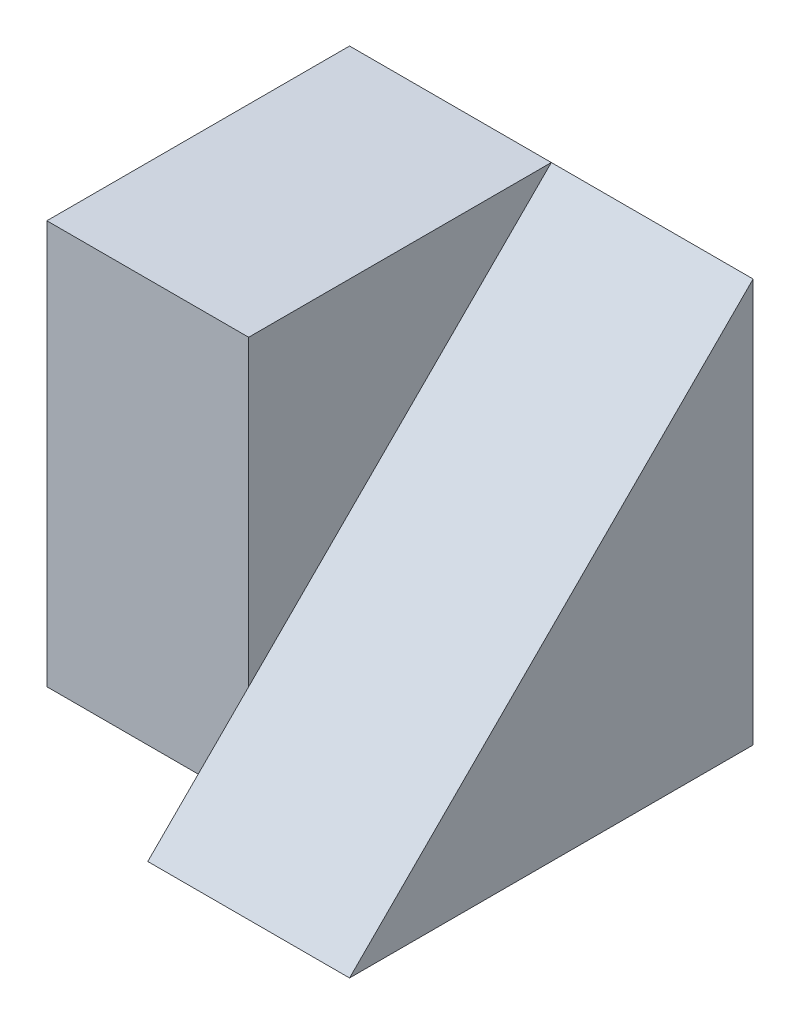
ISO-10303-21;
HEADER;
FILE_DESCRIPTION(('STEP AP214'),'2;1');
FILE_NAME('part.step','',(''),(''),'','','');
FILE_SCHEMA(('AUTOMOTIVE_DESIGN { 1 0 10303 214 1 1 1 1 }'));
ENDSEC;
DATA;
#1=APPLICATION_CONTEXT('core data for automotive mechanical design processes');
#2=APPLICATION_PROTOCOL_DEFINITION('international standard','automotive_design',2000,#1);
#3=PRODUCT_CONTEXT('',#1,'mechanical');
#4=PRODUCT('Part','Part','',(#3));
#5=PRODUCT_RELATED_PRODUCT_CATEGORY('part','',(#4));
#6=PRODUCT_DEFINITION_FORMATION('','',#4);
#7=PRODUCT_DEFINITION_CONTEXT('part definition',#1,'design');
#8=PRODUCT_DEFINITION('design','',#6,#7);
#9=PRODUCT_DEFINITION_SHAPE('','',#8);
#10=(LENGTH_UNIT() NAMED_UNIT(*) SI_UNIT(.MILLI.,.METRE.));
#11=(NAMED_UNIT(*) PLANE_ANGLE_UNIT() SI_UNIT($,.RADIAN.));
#12=(NAMED_UNIT(*) SI_UNIT($,.STERADIAN.) SOLID_ANGLE_UNIT());
#13=UNCERTAINTY_MEASURE_WITH_UNIT(LENGTH_MEASURE(1.E-05),#10,'distance_accuracy_value','');
#14=(GEOMETRIC_REPRESENTATION_CONTEXT(3) GLOBAL_UNCERTAINTY_ASSIGNED_CONTEXT((#13)) GLOBAL_UNIT_ASSIGNED_CONTEXT((#10,
#11,#12)) REPRESENTATION_CONTEXT('',''));
#15=CARTESIAN_POINT('',(0.,0.,0.));
#16=DIRECTION('',(0.,0.,1.));
#17=DIRECTION('',(1.,0.,0.));
#18=AXIS2_PLACEMENT_3D('',#15,#16,#17);
#19=CARTESIAN_POINT('',(2.,0.,0.));
#20=DIRECTION('',(0.,1.,0.));
#21=DIRECTION('',(0.,0.,1.));
#22=AXIS2_PLACEMENT_3D('',#19,#20,#21);
#23=PLANE('',#22);
#24=DIRECTION('',(0.,0.,-1.));
#25=VECTOR('',#24,1.);
#26=CARTESIAN_POINT('',(0.,0.,0.));
#27=LINE('',#26,#25);
#28=CARTESIAN_POINT('',(0.,0.,0.));
#29=VERTEX_POINT('',#28);
#30=CARTESIAN_POINT('',(0.,0.,-1.));
#31=VERTEX_POINT('',#30);
#32=EDGE_CURVE('E97',#29,#31,#27,.T.);
#33=ORIENTED_EDGE('',*,*,#32,.T.);
#34=DIRECTION('',(1.,0.,0.));
#35=VECTOR('',#34,1.);
#36=CARTESIAN_POINT('',(-2.,0.,-1.));
#37=LINE('',#36,#35);
#38=CARTESIAN_POINT('',(-2.,0.,-1.));
#39=VERTEX_POINT('',#38);
#40=EDGE_CURVE('E102',#39,#31,#37,.T.);
#41=ORIENTED_EDGE('',*,*,#40,.F.);
#42=DIRECTION('',(0.,0.,1.));
#43=VECTOR('',#42,1.);
#44=CARTESIAN_POINT('',(-2.,0.,-4.));
#45=LINE('',#44,#43);
#46=CARTESIAN_POINT('',(-2.,0.,-4.));
#47=VERTEX_POINT('',#46);
#48=EDGE_CURVE('E119',#47,#39,#45,.T.);
#49=ORIENTED_EDGE('',*,*,#48,.F.);
#50=DIRECTION('',(-1.,0.,0.));
#51=VECTOR('',#50,1.);
#52=CARTESIAN_POINT('',(2.,0.,-4.));
#53=LINE('',#52,#51);
#54=CARTESIAN_POINT('',(2.,0.,-4.));
#55=VERTEX_POINT('',#54);
#56=EDGE_CURVE('E42',#55,#47,#53,.T.);
#57=ORIENTED_EDGE('',*,*,#56,.F.);
#58=DIRECTION('',(0.,0.,-1.));
#59=VECTOR('',#58,1.);
#60=CARTESIAN_POINT('',(2.,0.,0.));
#61=LINE('',#60,#59);
#62=CARTESIAN_POINT('',(2.,0.,0.));
#63=VERTEX_POINT('',#62);
#64=EDGE_CURVE('E58',#63,#55,#61,.T.);
#65=ORIENTED_EDGE('',*,*,#64,.F.);
#66=DIRECTION('',(-1.,0.,0.));
#67=VECTOR('',#66,1.);
#68=CARTESIAN_POINT('',(2.,0.,0.));
#69=LINE('',#68,#67);
#70=EDGE_CURVE('E11',#63,#29,#69,.T.);
#71=ORIENTED_EDGE('',*,*,#70,.T.);
#72=EDGE_LOOP('',(#33,#41,#49,#57,#65,#71));
#73=FACE_BOUND('',#72,.T.);
#74=ADVANCED_FACE('F33',(#73),#23,.F.);
#75=CARTESIAN_POINT('',(2.,0.,-4.));
#76=DIRECTION('',(0.,0.,1.));
#77=DIRECTION('',(1.,0.,0.));
#78=AXIS2_PLACEMENT_3D('',#75,#76,#77);
#79=PLANE('',#78);
#80=ORIENTED_EDGE('',*,*,#56,.T.);
#81=DIRECTION('',(0.,-1.,0.));
#82=VECTOR('',#81,1.);
#83=CARTESIAN_POINT('',(-2.,4.,-4.));
#84=LINE('',#83,#82);
#85=CARTESIAN_POINT('',(-2.,4.,-4.));
#86=VERTEX_POINT('',#85);
#87=EDGE_CURVE('E123',#86,#47,#84,.T.);
#88=ORIENTED_EDGE('',*,*,#87,.F.);
#89=DIRECTION('',(-1.,0.,0.));
#90=VECTOR('',#89,1.);
#91=CARTESIAN_POINT('',(2.,4.,-4.));
#92=LINE('',#91,#90);
#93=CARTESIAN_POINT('',(0.,4.,-4.));
#94=VERTEX_POINT('',#93);
#95=EDGE_CURVE('E108',#94,#86,#92,.T.);
#96=ORIENTED_EDGE('',*,*,#95,.F.);
#97=CARTESIAN_POINT('',(2.,4.,-4.));
#98=VERTEX_POINT('',#97);
#99=EDGE_CURVE('E115',#98,#94,#92,.T.);
#100=ORIENTED_EDGE('',*,*,#99,.F.);
#101=DIRECTION('',(0.,1.,0.));
#102=VECTOR('',#101,1.);
#103=CARTESIAN_POINT('',(2.,0.,-4.));
#104=LINE('',#103,#102);
#105=EDGE_CURVE('E106',#55,#98,#104,.T.);
#106=ORIENTED_EDGE('',*,*,#105,.F.);
#107=EDGE_LOOP('',(#80,#88,#96,#100,#106));
#108=FACE_BOUND('',#107,.T.);
#109=ADVANCED_FACE('F148',(#108),#79,.F.);
#110=CARTESIAN_POINT('',(2.,4.,0.));
#111=DIRECTION('',(0.,-1.,0.));
#112=DIRECTION('',(0.,0.,-1.));
#113=AXIS2_PLACEMENT_3D('',#110,#111,#112);
#114=PLANE('',#113);
#115=DIRECTION('',(1.,0.,0.));
#116=VECTOR('',#115,1.);
#117=CARTESIAN_POINT('',(-2.,4.,-1.));
#118=LINE('',#117,#116);
#119=CARTESIAN_POINT('',(-2.,4.,-1.));
#120=VERTEX_POINT('',#119);
#121=CARTESIAN_POINT('',(0.,4.,-1.));
#122=VERTEX_POINT('',#121);
#123=EDGE_CURVE('E120',#120,#122,#118,.T.);
#124=ORIENTED_EDGE('',*,*,#123,.T.);
#125=DIRECTION('',(0.,0.,1.));
#126=VECTOR('',#125,1.);
#127=CARTESIAN_POINT('',(0.,4.,-4.));
#128=LINE('',#127,#126);
#129=EDGE_CURVE('E95',#94,#122,#128,.T.);
#130=ORIENTED_EDGE('',*,*,#129,.F.);
#131=ORIENTED_EDGE('',*,*,#95,.T.);
#132=DIRECTION('',(0.,0.,-1.));
#133=VECTOR('',#132,1.);
#134=CARTESIAN_POINT('',(-2.,4.,-1.));
#135=LINE('',#134,#133);
#136=EDGE_CURVE('E136',#120,#86,#135,.T.);
#137=ORIENTED_EDGE('',*,*,#136,.F.);
#138=EDGE_LOOP('',(#124,#130,#131,#137));
#139=FACE_BOUND('',#138,.T.);
#140=ADVANCED_FACE('F152',(#139),#114,.F.);
#141=CARTESIAN_POINT('',(2.,0.,0.));
#142=DIRECTION('',(-1.,0.,0.));
#143=DIRECTION('',(0.,0.,1.));
#144=AXIS2_PLACEMENT_3D('',#141,#142,#143);
#145=PLANE('',#144);
#146=ORIENTED_EDGE('',*,*,#105,.T.);
#147=DIRECTION('',(0.,0.707106781186548,-0.707106781186548));
#148=VECTOR('',#147,1.);
#149=CARTESIAN_POINT('',(2.,0.,0.));
#150=LINE('',#149,#148);
#151=EDGE_CURVE('E155',#63,#98,#150,.T.);
#152=ORIENTED_EDGE('',*,*,#151,.F.);
#153=ORIENTED_EDGE('',*,*,#64,.T.);
#154=EDGE_LOOP('',(#146,#152,#153));
#155=FACE_BOUND('',#154,.T.);
#156=ADVANCED_FACE('F157',(#155),#145,.F.);
#157=CARTESIAN_POINT('',(0.,0.,0.));
#158=DIRECTION('',(-1.,0.,0.));
#159=DIRECTION('',(0.,0.,1.));
#160=AXIS2_PLACEMENT_3D('',#157,#158,#159);
#161=PLANE('',#160);
#162=DIRECTION('',(0.,0.707106781186548,-0.707106781186548));
#163=VECTOR('',#162,1.);
#164=CARTESIAN_POINT('',(0.,0.,0.));
#165=LINE('',#164,#163);
#166=CARTESIAN_POINT('',(0.,1.,-1.));
#167=VERTEX_POINT('',#166);
#168=EDGE_CURVE('E91',#29,#167,#165,.T.);
#169=ORIENTED_EDGE('',*,*,#168,.T.);
#170=DIRECTION('',(0.,1.,0.));
#171=VECTOR('',#170,1.);
#172=CARTESIAN_POINT('',(0.,0.,-1.));
#173=LINE('',#172,#171);
#174=EDGE_CURVE('E50',#31,#167,#173,.T.);
#175=ORIENTED_EDGE('',*,*,#174,.F.);
#176=ORIENTED_EDGE('',*,*,#32,.F.);
#177=EDGE_LOOP('',(#169,#175,#176));
#178=FACE_BOUND('',#177,.T.);
#179=ADVANCED_FACE('F98',(#178),#161,.T.);
#180=CARTESIAN_POINT('',(-2.,0.,-1.));
#181=DIRECTION('',(0.,0.,-1.));
#182=DIRECTION('',(-1.,0.,0.));
#183=AXIS2_PLACEMENT_3D('',#180,#181,#182);
#184=PLANE('',#183);
#185=ORIENTED_EDGE('',*,*,#174,.T.);
#186=EDGE_CURVE('E36',#167,#122,#173,.T.);
#187=ORIENTED_EDGE('',*,*,#186,.T.);
#188=ORIENTED_EDGE('',*,*,#123,.F.);
#189=DIRECTION('',(0.,1.,0.));
#190=VECTOR('',#189,1.);
#191=CARTESIAN_POINT('',(-2.,0.,-1.));
#192=LINE('',#191,#190);
#193=EDGE_CURVE('E131',#39,#120,#192,.T.);
#194=ORIENTED_EDGE('',*,*,#193,.F.);
#195=ORIENTED_EDGE('',*,*,#40,.T.);
#196=EDGE_LOOP('',(#185,#187,#188,#194,#195));
#197=FACE_BOUND('',#196,.T.);
#198=ADVANCED_FACE('F128',(#197),#184,.F.);
#199=CARTESIAN_POINT('',(-2.,0.,0.));
#200=DIRECTION('',(-1.,0.,0.));
#201=DIRECTION('',(0.,0.,1.));
#202=AXIS2_PLACEMENT_3D('',#199,#200,#201);
#203=PLANE('',#202);
#204=ORIENTED_EDGE('',*,*,#48,.T.);
#205=ORIENTED_EDGE('',*,*,#193,.T.);
#206=ORIENTED_EDGE('',*,*,#136,.T.);
#207=ORIENTED_EDGE('',*,*,#87,.T.);
#208=EDGE_LOOP('',(#204,#205,#206,#207));
#209=FACE_BOUND('',#208,.T.);
#210=ADVANCED_FACE('F144',(#209),#203,.T.);
#211=CARTESIAN_POINT('',(0.,0.,0.));
#212=DIRECTION('',(-1.,0.,0.));
#213=DIRECTION('',(0.,0.,1.));
#214=AXIS2_PLACEMENT_3D('',#211,#212,#213);
#215=PLANE('',#214);
#216=EDGE_CURVE('E94',#167,#94,#165,.T.);
#217=ORIENTED_EDGE('',*,*,#216,.T.);
#218=ORIENTED_EDGE('',*,*,#129,.T.);
#219=ORIENTED_EDGE('',*,*,#186,.F.);
#220=EDGE_LOOP('',(#217,#218,#219));
#221=FACE_BOUND('',#220,.T.);
#222=ADVANCED_FACE('F154',(#221),#215,.F.);
#223=CARTESIAN_POINT('',(0.,0.,0.));
#224=DIRECTION('',(0.,-0.707106781186547,-0.707106781186547));
#225=DIRECTION('',(0.,0.707106781186548,-0.707106781186548));
#226=AXIS2_PLACEMENT_3D('',#223,#224,#225);
#227=PLANE('',#226);
#228=ORIENTED_EDGE('',*,*,#151,.T.);
#229=ORIENTED_EDGE('',*,*,#99,.T.);
#230=ORIENTED_EDGE('',*,*,#216,.F.);
#231=ORIENTED_EDGE('',*,*,#168,.F.);
#232=ORIENTED_EDGE('',*,*,#70,.F.);
#233=EDGE_LOOP('',(#228,#229,#230,#231,#232));
#234=FACE_BOUND('',#233,.T.);
#235=ADVANCED_FACE('F92',(#234),#227,.F.);
#236=CLOSED_SHELL('',(#74,#109,#140,#156,#179,#198,#210,#222,#235));
#237=MANIFOLD_SOLID_BREP('B2',#236);
#238=ADVANCED_BREP_SHAPE_REPRESENTATION('',(#18,#237),#14);
#239=SHAPE_DEFINITION_REPRESENTATION(#9,#238);
ENDSEC;
END-ISO-10303-21;
